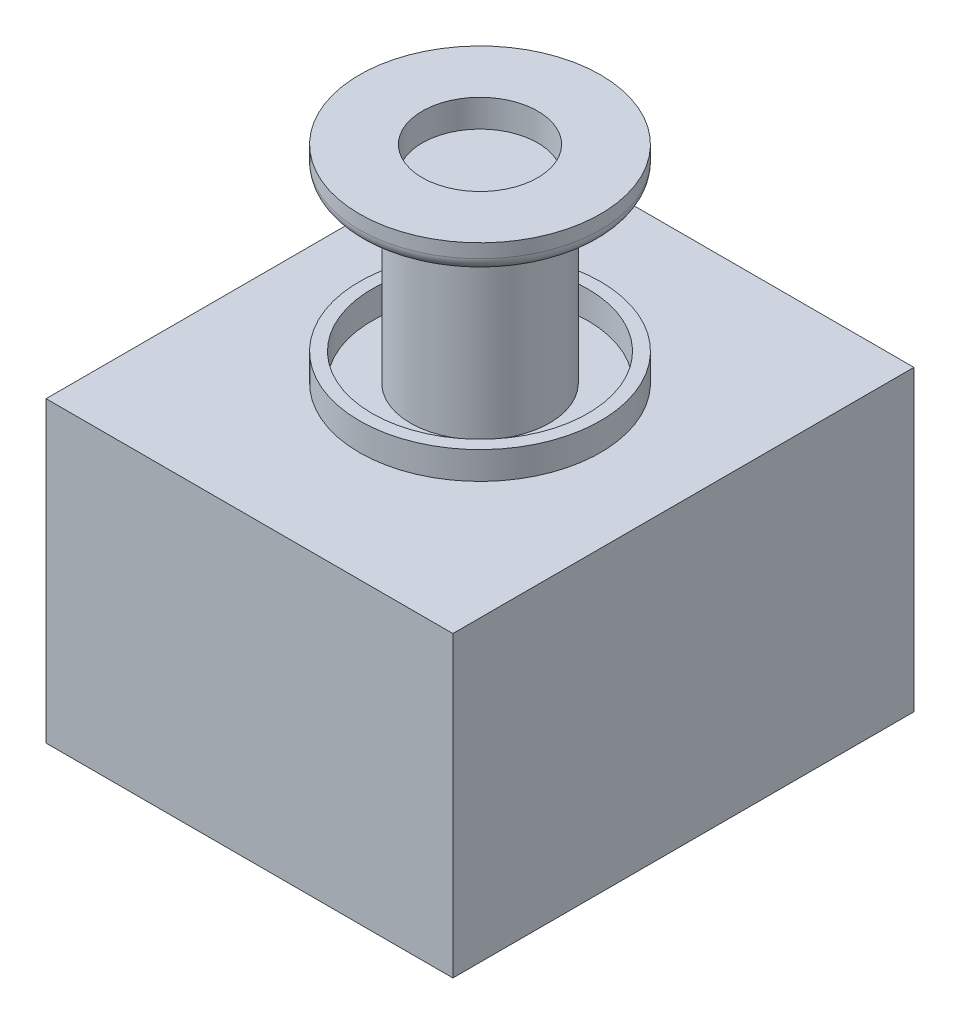
ISO-10303-21;
HEADER;
FILE_DESCRIPTION(('STEP AP214'),'2;1');
FILE_NAME('part.step','',(''),(''),'','','');
FILE_SCHEMA(('AUTOMOTIVE_DESIGN { 1 0 10303 214 1 1 1 1 }'));
ENDSEC;
DATA;
#1=APPLICATION_CONTEXT('core data for automotive mechanical design processes');
#2=APPLICATION_PROTOCOL_DEFINITION('international standard','automotive_design',2000,#1);
#3=PRODUCT_CONTEXT('',#1,'mechanical');
#4=PRODUCT('Part','Part','',(#3));
#5=PRODUCT_RELATED_PRODUCT_CATEGORY('part','',(#4));
#6=PRODUCT_DEFINITION_FORMATION('','',#4);
#7=PRODUCT_DEFINITION_CONTEXT('part definition',#1,'design');
#8=PRODUCT_DEFINITION('design','',#6,#7);
#9=PRODUCT_DEFINITION_SHAPE('','',#8);
#10=(LENGTH_UNIT() NAMED_UNIT(*) SI_UNIT(.MILLI.,.METRE.));
#11=(NAMED_UNIT(*) PLANE_ANGLE_UNIT() SI_UNIT($,.RADIAN.));
#12=(NAMED_UNIT(*) SI_UNIT($,.STERADIAN.) SOLID_ANGLE_UNIT());
#13=UNCERTAINTY_MEASURE_WITH_UNIT(LENGTH_MEASURE(1.E-05),#10,'distance_accuracy_value','');
#14=(GEOMETRIC_REPRESENTATION_CONTEXT(3) GLOBAL_UNCERTAINTY_ASSIGNED_CONTEXT((#13)) GLOBAL_UNIT_ASSIGNED_CONTEXT((#10,
#11,#12)) REPRESENTATION_CONTEXT('',''));
#15=CARTESIAN_POINT('',(0.,0.,0.));
#16=DIRECTION('',(0.,0.,1.));
#17=DIRECTION('',(1.,0.,0.));
#18=AXIS2_PLACEMENT_3D('',#15,#16,#17);
#19=CARTESIAN_POINT('',(37.5,55.,-42.5));
#20=DIRECTION('',(-1.,0.,0.));
#21=DIRECTION('',(0.,0.,1.));
#22=AXIS2_PLACEMENT_3D('',#19,#20,#21);
#23=PLANE('',#22);
#24=DIRECTION('',(0.,0.,-1.));
#25=VECTOR('',#24,1.);
#26=CARTESIAN_POINT('',(37.5,0.,-42.5));
#27=LINE('',#26,#25);
#28=CARTESIAN_POINT('',(37.5,0.,42.5));
#29=VERTEX_POINT('',#28);
#30=CARTESIAN_POINT('',(37.5,0.,-42.5));
#31=VERTEX_POINT('',#30);
#32=EDGE_CURVE('E116',#29,#31,#27,.T.);
#33=ORIENTED_EDGE('',*,*,#32,.T.);
#34=DIRECTION('',(0.,-1.,0.));
#35=VECTOR('',#34,1.);
#36=CARTESIAN_POINT('',(37.5,55.,-42.5));
#37=LINE('',#36,#35);
#38=CARTESIAN_POINT('',(37.5,55.,-42.5));
#39=VERTEX_POINT('',#38);
#40=EDGE_CURVE('E105',#39,#31,#37,.T.);
#41=ORIENTED_EDGE('',*,*,#40,.F.);
#42=DIRECTION('',(0.,0.,-1.));
#43=VECTOR('',#42,1.);
#44=CARTESIAN_POINT('',(37.5,55.,-42.5));
#45=LINE('',#44,#43);
#46=CARTESIAN_POINT('',(37.5,55.,42.5));
#47=VERTEX_POINT('',#46);
#48=EDGE_CURVE('E97',#47,#39,#45,.T.);
#49=ORIENTED_EDGE('',*,*,#48,.F.);
#50=DIRECTION('',(0.,-1.,0.));
#51=VECTOR('',#50,1.);
#52=CARTESIAN_POINT('',(37.5,55.,42.5));
#53=LINE('',#52,#51);
#54=EDGE_CURVE('E112',#47,#29,#53,.T.);
#55=ORIENTED_EDGE('',*,*,#54,.T.);
#56=EDGE_LOOP('',(#33,#41,#49,#55));
#57=FACE_BOUND('',#56,.T.);
#58=ADVANCED_FACE('F43',(#57),#23,.F.);
#59=CARTESIAN_POINT('',(-37.5,55.,-42.5));
#60=DIRECTION('',(0.,0.,1.));
#61=DIRECTION('',(1.,0.,0.));
#62=AXIS2_PLACEMENT_3D('',#59,#60,#61);
#63=PLANE('',#62);
#64=DIRECTION('',(-1.,0.,0.));
#65=VECTOR('',#64,1.);
#66=CARTESIAN_POINT('',(-37.5,0.,-42.5));
#67=LINE('',#66,#65);
#68=CARTESIAN_POINT('',(-37.5,0.,-42.5));
#69=VERTEX_POINT('',#68);
#70=EDGE_CURVE('E103',#31,#69,#67,.T.);
#71=ORIENTED_EDGE('',*,*,#70,.T.);
#72=DIRECTION('',(0.,-1.,0.));
#73=VECTOR('',#72,1.);
#74=CARTESIAN_POINT('',(-37.5,55.,-42.5));
#75=LINE('',#74,#73);
#76=CARTESIAN_POINT('',(-37.5,55.,-42.5));
#77=VERTEX_POINT('',#76);
#78=EDGE_CURVE('E101',#77,#69,#75,.T.);
#79=ORIENTED_EDGE('',*,*,#78,.F.);
#80=DIRECTION('',(-1.,0.,0.));
#81=VECTOR('',#80,1.);
#82=CARTESIAN_POINT('',(-37.5,55.,-42.5));
#83=LINE('',#82,#81);
#84=EDGE_CURVE('E92',#39,#77,#83,.T.);
#85=ORIENTED_EDGE('',*,*,#84,.F.);
#86=ORIENTED_EDGE('',*,*,#40,.T.);
#87=EDGE_LOOP('',(#71,#79,#85,#86));
#88=FACE_BOUND('',#87,.T.);
#89=ADVANCED_FACE('F102',(#88),#63,.F.);
#90=CARTESIAN_POINT('',(-37.5,55.,-42.5));
#91=DIRECTION('',(1.,0.,0.));
#92=DIRECTION('',(0.,0.,-1.));
#93=AXIS2_PLACEMENT_3D('',#90,#91,#92);
#94=PLANE('',#93);
#95=DIRECTION('',(0.,0.,1.));
#96=VECTOR('',#95,1.);
#97=CARTESIAN_POINT('',(-37.5,0.,-42.5));
#98=LINE('',#97,#96);
#99=CARTESIAN_POINT('',(-37.5,0.,42.5));
#100=VERTEX_POINT('',#99);
#101=EDGE_CURVE('E78',#69,#100,#98,.T.);
#102=ORIENTED_EDGE('',*,*,#101,.T.);
#103=DIRECTION('',(0.,-1.,0.));
#104=VECTOR('',#103,1.);
#105=CARTESIAN_POINT('',(-37.5,55.,42.5));
#106=LINE('',#105,#104);
#107=CARTESIAN_POINT('',(-37.5,55.,42.5));
#108=VERTEX_POINT('',#107);
#109=EDGE_CURVE('E106',#108,#100,#106,.T.);
#110=ORIENTED_EDGE('',*,*,#109,.F.);
#111=DIRECTION('',(0.,0.,1.));
#112=VECTOR('',#111,1.);
#113=CARTESIAN_POINT('',(-37.5,55.,-42.5));
#114=LINE('',#113,#112);
#115=EDGE_CURVE('E95',#77,#108,#114,.T.);
#116=ORIENTED_EDGE('',*,*,#115,.F.);
#117=ORIENTED_EDGE('',*,*,#78,.T.);
#118=EDGE_LOOP('',(#102,#110,#116,#117));
#119=FACE_BOUND('',#118,.T.);
#120=ADVANCED_FACE('F108',(#119),#94,.F.);
#121=CARTESIAN_POINT('',(-37.5,55.,42.5));
#122=DIRECTION('',(0.,0.,-1.));
#123=DIRECTION('',(-1.,0.,0.));
#124=AXIS2_PLACEMENT_3D('',#121,#122,#123);
#125=PLANE('',#124);
#126=DIRECTION('',(1.,0.,0.));
#127=VECTOR('',#126,1.);
#128=CARTESIAN_POINT('',(-37.5,0.,42.5));
#129=LINE('',#128,#127);
#130=EDGE_CURVE('E84',#100,#29,#129,.T.);
#131=ORIENTED_EDGE('',*,*,#130,.T.);
#132=ORIENTED_EDGE('',*,*,#54,.F.);
#133=DIRECTION('',(1.,0.,0.));
#134=VECTOR('',#133,1.);
#135=CARTESIAN_POINT('',(-37.5,55.,42.5));
#136=LINE('',#135,#134);
#137=EDGE_CURVE('E61',#108,#47,#136,.T.);
#138=ORIENTED_EDGE('',*,*,#137,.F.);
#139=ORIENTED_EDGE('',*,*,#109,.T.);
#140=EDGE_LOOP('',(#131,#132,#138,#139));
#141=FACE_BOUND('',#140,.T.);
#142=ADVANCED_FACE('F196',(#141),#125,.F.);
#143=CARTESIAN_POINT('',(0.,55.,0.));
#144=DIRECTION('',(0.,1.,0.));
#145=DIRECTION('',(0.,0.,1.));
#146=AXIS2_PLACEMENT_3D('',#143,#144,#145);
#147=PLANE('',#146);
#148=CARTESIAN_POINT('',(0.,55.,0.));
#149=DIRECTION('',(0.,1.,0.));
#150=DIRECTION('',(0.,0.,1.));
#151=AXIS2_PLACEMENT_3D('',#148,#149,#150);
#152=CIRCLE('',#151,22.225);
#153=CARTESIAN_POINT('',(0.,55.,22.225));
#154=VERTEX_POINT('',#153);
#155=EDGE_CURVE('E133',#154,#154,#152,.T.);
#156=ORIENTED_EDGE('',*,*,#155,.F.);
#157=EDGE_LOOP('',(#156));
#158=FACE_BOUND('',#157,.T.);
#159=ORIENTED_EDGE('',*,*,#48,.T.);
#160=ORIENTED_EDGE('',*,*,#84,.T.);
#161=ORIENTED_EDGE('',*,*,#115,.T.);
#162=ORIENTED_EDGE('',*,*,#137,.T.);
#163=EDGE_LOOP('',(#159,#160,#161,#162));
#164=FACE_BOUND('',#163,.T.);
#165=ADVANCED_FACE('F93',(#158,#164),#147,.T.);
#166=CARTESIAN_POINT('',(0.,0.,0.));
#167=DIRECTION('',(0.,1.,0.));
#168=DIRECTION('',(0.,0.,1.));
#169=AXIS2_PLACEMENT_3D('',#166,#167,#168);
#170=PLANE('',#169);
#171=ORIENTED_EDGE('',*,*,#32,.F.);
#172=ORIENTED_EDGE('',*,*,#130,.F.);
#173=ORIENTED_EDGE('',*,*,#101,.F.);
#174=ORIENTED_EDGE('',*,*,#70,.F.);
#175=EDGE_LOOP('',(#171,#172,#173,#174));
#176=FACE_BOUND('',#175,.T.);
#177=ADVANCED_FACE('F195',(#176),#170,.F.);
#178=CARTESIAN_POINT('',(0.,60.08,0.));
#179=DIRECTION('',(0.,-1.,0.));
#180=DIRECTION('',(0.,0.,-1.));
#181=AXIS2_PLACEMENT_3D('',#178,#179,#180);
#182=CYLINDRICAL_SURFACE('',#181,22.225);
#183=CARTESIAN_POINT('',(0.,60.08,0.));
#184=DIRECTION('',(0.,1.,0.));
#185=DIRECTION('',(0.,0.,1.));
#186=AXIS2_PLACEMENT_3D('',#183,#184,#185);
#187=CIRCLE('',#186,22.225);
#188=CARTESIAN_POINT('',(0.,60.08,22.225));
#189=VERTEX_POINT('',#188);
#190=EDGE_CURVE('E120',#189,#189,#187,.T.);
#191=ORIENTED_EDGE('',*,*,#190,.F.);
#192=EDGE_LOOP('',(#191));
#193=FACE_BOUND('',#192,.T.);
#194=ORIENTED_EDGE('',*,*,#155,.T.);
#195=EDGE_LOOP('',(#194));
#196=FACE_BOUND('',#195,.T.);
#197=ADVANCED_FACE('F192',(#193,#196),#182,.T.);
#198=CARTESIAN_POINT('',(0.,60.08,0.));
#199=DIRECTION('',(0.,1.,0.));
#200=DIRECTION('',(0.,0.,1.));
#201=AXIS2_PLACEMENT_3D('',#198,#199,#200);
#202=PLANE('',#201);
#203=CARTESIAN_POINT('',(0.,60.08,0.));
#204=DIRECTION('',(0.,1.,0.));
#205=DIRECTION('',(0.,0.,1.));
#206=AXIS2_PLACEMENT_3D('',#203,#204,#205);
#207=CIRCLE('',#206,19.8905572652715);
#208=CARTESIAN_POINT('',(0.,60.08,19.8905572652715));
#209=VERTEX_POINT('',#208);
#210=EDGE_CURVE('E170',#209,#209,#207,.T.);
#211=ORIENTED_EDGE('',*,*,#210,.F.);
#212=EDGE_LOOP('',(#211));
#213=FACE_BOUND('',#212,.T.);
#214=ORIENTED_EDGE('',*,*,#190,.T.);
#215=EDGE_LOOP('',(#214));
#216=FACE_BOUND('',#215,.T.);
#217=ADVANCED_FACE('F245',(#213,#216),#202,.T.);
#218=CARTESIAN_POINT('',(0.,55.,0.));
#219=DIRECTION('',(0.,1.,0.));
#220=DIRECTION('',(0.,0.,1.));
#221=AXIS2_PLACEMENT_3D('',#218,#219,#220);
#222=CYLINDRICAL_SURFACE('',#221,19.8905572652715);
#223=CARTESIAN_POINT('',(0.,55.,0.));
#224=DIRECTION('',(0.,1.,0.));
#225=DIRECTION('',(0.,0.,1.));
#226=AXIS2_PLACEMENT_3D('',#223,#224,#225);
#227=CIRCLE('',#226,19.8905572652715);
#228=CARTESIAN_POINT('',(0.,55.,19.8905572652715));
#229=VERTEX_POINT('',#228);
#230=EDGE_CURVE('E177',#229,#229,#227,.T.);
#231=ORIENTED_EDGE('',*,*,#230,.F.);
#232=EDGE_LOOP('',(#231));
#233=FACE_BOUND('',#232,.T.);
#234=ORIENTED_EDGE('',*,*,#210,.T.);
#235=EDGE_LOOP('',(#234));
#236=FACE_BOUND('',#235,.T.);
#237=ADVANCED_FACE('F255',(#233,#236),#222,.F.);
#238=CARTESIAN_POINT('',(0.,55.,0.));
#239=DIRECTION('',(0.,1.,0.));
#240=DIRECTION('',(0.,0.,1.));
#241=AXIS2_PLACEMENT_3D('',#238,#239,#240);
#242=PLANE('',#241);
#243=CARTESIAN_POINT('',(0.,55.,0.));
#244=DIRECTION('',(0.,1.,0.));
#245=DIRECTION('',(0.,0.,1.));
#246=AXIS2_PLACEMENT_3D('',#243,#244,#245);
#247=CIRCLE('',#246,12.8197082259835);
#248=CARTESIAN_POINT('',(0.,55.,12.8197082259835));
#249=VERTEX_POINT('',#248);
#250=EDGE_CURVE('E164',#249,#249,#247,.T.);
#251=ORIENTED_EDGE('',*,*,#250,.F.);
#252=EDGE_LOOP('',(#251));
#253=FACE_BOUND('',#252,.T.);
#254=ORIENTED_EDGE('',*,*,#230,.T.);
#255=EDGE_LOOP('',(#254));
#256=FACE_BOUND('',#255,.T.);
#257=ADVANCED_FACE('F266',(#253,#256),#242,.T.);
#258=CARTESIAN_POINT('',(0.,88.02,0.));
#259=DIRECTION('',(0.,-1.,0.));
#260=DIRECTION('',(0.,0.,-1.));
#261=AXIS2_PLACEMENT_3D('',#258,#259,#260);
#262=CYLINDRICAL_SURFACE('',#261,12.8197082259835);
#263=CARTESIAN_POINT('',(0.,85.48,0.));
#264=DIRECTION('',(0.,1.,0.));
#265=DIRECTION('',(0.,0.,1.));
#266=AXIS2_PLACEMENT_3D('',#263,#264,#265);
#267=CIRCLE('',#266,12.8197082259835);
#268=CARTESIAN_POINT('',(0.,85.48,12.8197082259835));
#269=VERTEX_POINT('',#268);
#270=EDGE_CURVE('E11',#269,#269,#267,.F.);
#271=ORIENTED_EDGE('',*,*,#270,.T.);
#272=EDGE_LOOP('',(#271));
#273=FACE_BOUND('',#272,.T.);
#274=ORIENTED_EDGE('',*,*,#250,.T.);
#275=EDGE_LOOP('',(#274));
#276=FACE_BOUND('',#275,.T.);
#277=ADVANCED_FACE('F157',(#273,#276),#262,.T.);
#278=CARTESIAN_POINT('',(0.,93.1,0.));
#279=DIRECTION('',(0.,-1.,0.));
#280=DIRECTION('',(0.,0.,-1.));
#281=AXIS2_PLACEMENT_3D('',#278,#279,#280);
#282=CYLINDRICAL_SURFACE('',#281,22.225);
#283=CARTESIAN_POINT('',(0.,90.56,0.));
#284=DIRECTION('',(0.,1.,0.));
#285=DIRECTION('',(0.,0.,1.));
#286=AXIS2_PLACEMENT_3D('',#283,#284,#285);
#287=CIRCLE('',#286,22.225);
#288=CARTESIAN_POINT('',(0.,90.56,22.225));
#289=VERTEX_POINT('',#288);
#290=EDGE_CURVE('E134',#289,#289,#287,.T.);
#291=ORIENTED_EDGE('',*,*,#290,.T.);
#292=EDGE_LOOP('',(#291));
#293=FACE_BOUND('',#292,.T.);
#294=CARTESIAN_POINT('',(0.,93.1,0.));
#295=DIRECTION('',(0.,1.,0.));
#296=DIRECTION('',(0.,0.,1.));
#297=AXIS2_PLACEMENT_3D('',#294,#295,#296);
#298=CIRCLE('',#297,22.225);
#299=CARTESIAN_POINT('',(0.,93.1,22.225));
#300=VERTEX_POINT('',#299);
#301=EDGE_CURVE('E161',#300,#300,#298,.T.);
#302=ORIENTED_EDGE('',*,*,#301,.F.);
#303=EDGE_LOOP('',(#302));
#304=FACE_BOUND('',#303,.T.);
#305=ADVANCED_FACE('F153',(#293,#304),#282,.T.);
#306=CARTESIAN_POINT('',(0.,93.1,0.));
#307=DIRECTION('',(0.,1.,0.));
#308=DIRECTION('',(0.,0.,1.));
#309=AXIS2_PLACEMENT_3D('',#306,#307,#308);
#310=PLANE('',#309);
#311=CARTESIAN_POINT('',(0.,93.1,0.));
#312=DIRECTION('',(0.,1.,0.));
#313=DIRECTION('',(0.,0.,1.));
#314=AXIS2_PLACEMENT_3D('',#311,#312,#313);
#315=CIRCLE('',#314,10.645057698989);
#316=CARTESIAN_POINT('',(0.,93.1,10.645057698989));
#317=VERTEX_POINT('',#316);
#318=EDGE_CURVE('E173',#317,#317,#315,.T.);
#319=ORIENTED_EDGE('',*,*,#318,.F.);
#320=EDGE_LOOP('',(#319));
#321=FACE_BOUND('',#320,.T.);
#322=ORIENTED_EDGE('',*,*,#301,.T.);
#323=EDGE_LOOP('',(#322));
#324=FACE_BOUND('',#323,.T.);
#325=ADVANCED_FACE('F156',(#321,#324),#310,.T.);
#326=CARTESIAN_POINT('',(0.,88.02,0.));
#327=DIRECTION('',(0.,1.,0.));
#328=DIRECTION('',(0.,0.,1.));
#329=AXIS2_PLACEMENT_3D('',#326,#327,#328);
#330=PLANE('',#329);
#331=CARTESIAN_POINT('',(0.,88.02,0.));
#332=DIRECTION('',(0.,1.,0.));
#333=DIRECTION('',(0.,0.,1.));
#334=AXIS2_PLACEMENT_3D('',#331,#332,#333);
#335=CIRCLE('',#334,19.685);
#336=CARTESIAN_POINT('',(0.,88.02,19.685));
#337=VERTEX_POINT('',#336);
#338=EDGE_CURVE('E53',#337,#337,#335,.F.);
#339=ORIENTED_EDGE('',*,*,#338,.T.);
#340=EDGE_LOOP('',(#339));
#341=FACE_BOUND('',#340,.T.);
#342=CARTESIAN_POINT('',(0.,88.02,0.));
#343=DIRECTION('',(0.,1.,0.));
#344=DIRECTION('',(0.,0.,1.));
#345=AXIS2_PLACEMENT_3D('',#342,#343,#344);
#346=CIRCLE('',#345,15.3597082259835);
#347=CARTESIAN_POINT('',(0.,88.02,15.3597082259835));
#348=VERTEX_POINT('',#347);
#349=EDGE_CURVE('E138',#348,#348,#346,.T.);
#350=ORIENTED_EDGE('',*,*,#349,.T.);
#351=EDGE_LOOP('',(#350));
#352=FACE_BOUND('',#351,.T.);
#353=ADVANCED_FACE('F145',(#341,#352),#330,.F.);
#354=CARTESIAN_POINT('',(0.,90.56,0.));
#355=DIRECTION('',(0.,1.,0.));
#356=DIRECTION('',(0.,0.,1.));
#357=AXIS2_PLACEMENT_3D('',#354,#355,#356);
#358=TOROIDAL_SURFACE('',#357,19.685,2.54);
#359=ORIENTED_EDGE('',*,*,#338,.F.);
#360=EDGE_LOOP('',(#359));
#361=FACE_BOUND('',#360,.T.);
#362=ORIENTED_EDGE('',*,*,#290,.F.);
#363=EDGE_LOOP('',(#362));
#364=FACE_BOUND('',#363,.T.);
#365=ADVANCED_FACE('F148',(#361,#364),#358,.T.);
#366=CARTESIAN_POINT('',(0.,85.48,0.));
#367=DIRECTION('',(0.,1.,0.));
#368=DIRECTION('',(0.,0.,1.));
#369=AXIS2_PLACEMENT_3D('',#366,#367,#368);
#370=TOROIDAL_SURFACE('',#369,15.3597082259835,2.54);
#371=ORIENTED_EDGE('',*,*,#270,.F.);
#372=EDGE_LOOP('',(#371));
#373=FACE_BOUND('',#372,.T.);
#374=ORIENTED_EDGE('',*,*,#349,.F.);
#375=EDGE_LOOP('',(#374));
#376=FACE_BOUND('',#375,.T.);
#377=ADVANCED_FACE('F45',(#373,#376),#370,.F.);
#378=CARTESIAN_POINT('',(0.,88.02,0.));
#379=DIRECTION('',(0.,1.,0.));
#380=DIRECTION('',(0.,0.,1.));
#381=AXIS2_PLACEMENT_3D('',#378,#379,#380);
#382=CYLINDRICAL_SURFACE('',#381,10.645057698989);
#383=CARTESIAN_POINT('',(0.,88.02,0.));
#384=DIRECTION('',(0.,1.,0.));
#385=DIRECTION('',(0.,0.,1.));
#386=AXIS2_PLACEMENT_3D('',#383,#384,#385);
#387=CIRCLE('',#386,10.645057698989);
#388=CARTESIAN_POINT('',(0.,88.02,10.645057698989));
#389=VERTEX_POINT('',#388);
#390=EDGE_CURVE('E165',#389,#389,#387,.T.);
#391=ORIENTED_EDGE('',*,*,#390,.F.);
#392=EDGE_LOOP('',(#391));
#393=FACE_BOUND('',#392,.T.);
#394=ORIENTED_EDGE('',*,*,#318,.T.);
#395=EDGE_LOOP('',(#394));
#396=FACE_BOUND('',#395,.T.);
#397=ADVANCED_FACE('F322',(#393,#396),#382,.F.);
#398=CARTESIAN_POINT('',(0.,88.02,0.));
#399=DIRECTION('',(0.,1.,0.));
#400=DIRECTION('',(0.,0.,1.));
#401=AXIS2_PLACEMENT_3D('',#398,#399,#400);
#402=PLANE('',#401);
#403=ORIENTED_EDGE('',*,*,#390,.T.);
#404=EDGE_LOOP('',(#403));
#405=FACE_BOUND('',#404,.T.);
#406=ADVANCED_FACE('F340',(#405),#402,.T.);
#407=CLOSED_SHELL('',(#58,#89,#120,#142,#165,#177,#197,#217,#237,#257,#277,#305,#325,#353,#365,
#377,#397,#406));
#408=MANIFOLD_SOLID_BREP('B2',#407);
#409=ADVANCED_BREP_SHAPE_REPRESENTATION('',(#18,#408),#14);
#410=SHAPE_DEFINITION_REPRESENTATION(#9,#409);
ENDSEC;
END-ISO-10303-21;
